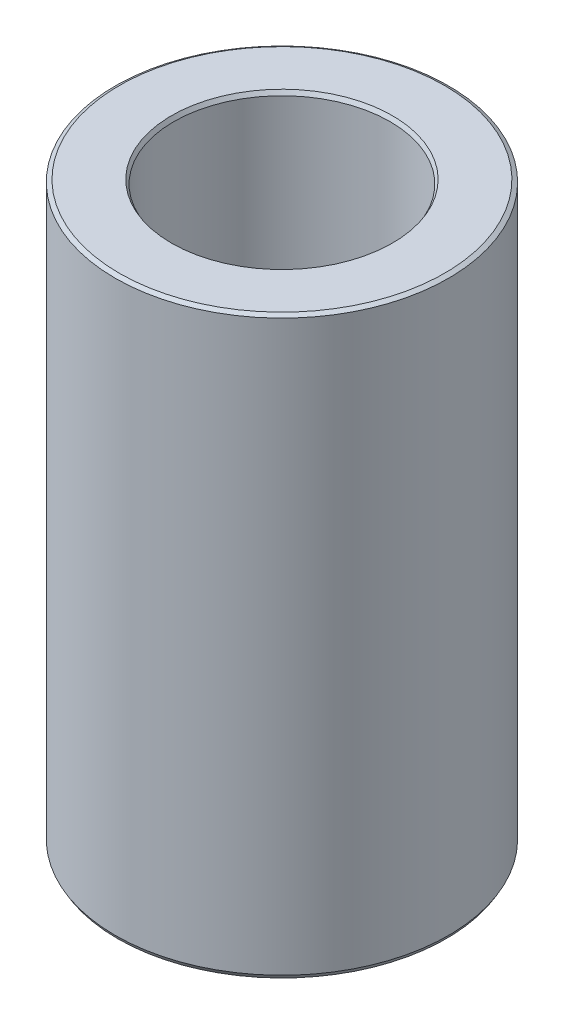
ISO-10303-21;
HEADER;
FILE_DESCRIPTION(('STEP AP214'),'2;1');
FILE_NAME('part.step','',(''),(''),'','','');
FILE_SCHEMA(('AUTOMOTIVE_DESIGN { 1 0 10303 214 1 1 1 1 }'));
ENDSEC;
DATA;
#1=APPLICATION_CONTEXT('core data for automotive mechanical design processes');
#2=APPLICATION_PROTOCOL_DEFINITION('international standard','automotive_design',2000,#1);
#3=PRODUCT_CONTEXT('',#1,'mechanical');
#4=PRODUCT('Part','Part','',(#3));
#5=PRODUCT_RELATED_PRODUCT_CATEGORY('part','',(#4));
#6=PRODUCT_DEFINITION_FORMATION('','',#4);
#7=PRODUCT_DEFINITION_CONTEXT('part definition',#1,'design');
#8=PRODUCT_DEFINITION('design','',#6,#7);
#9=PRODUCT_DEFINITION_SHAPE('','',#8);
#10=(LENGTH_UNIT() NAMED_UNIT(*) SI_UNIT(.MILLI.,.METRE.));
#11=(NAMED_UNIT(*) PLANE_ANGLE_UNIT() SI_UNIT($,.RADIAN.));
#12=(NAMED_UNIT(*) SI_UNIT($,.STERADIAN.) SOLID_ANGLE_UNIT());
#13=UNCERTAINTY_MEASURE_WITH_UNIT(LENGTH_MEASURE(1.E-05),#10,'distance_accuracy_value','');
#14=(GEOMETRIC_REPRESENTATION_CONTEXT(3) GLOBAL_UNCERTAINTY_ASSIGNED_CONTEXT((#13)) GLOBAL_UNIT_ASSIGNED_CONTEXT((#10,
#11,#12)) REPRESENTATION_CONTEXT('',''));
#15=CARTESIAN_POINT('',(0.,0.,0.));
#16=DIRECTION('',(0.,0.,1.));
#17=DIRECTION('',(1.,0.,0.));
#18=AXIS2_PLACEMENT_3D('',#15,#16,#17);
#19=CARTESIAN_POINT('',(0.,189.913354493686,0.));
#20=DIRECTION('',(0.,-1.,0.));
#21=DIRECTION('',(0.,0.,-1.));
#22=AXIS2_PLACEMENT_3D('',#19,#20,#21);
#23=CYLINDRICAL_SURFACE('',#22,55.);
#24=CARTESIAN_POINT('',(0.,1.32773117109544,0.));
#25=DIRECTION('',(0.,1.,0.));
#26=DIRECTION('',(0.,0.,1.));
#27=AXIS2_PLACEMENT_3D('',#24,#25,#26);
#28=CIRCLE('',#27,55.);
#29=CARTESIAN_POINT('',(0.,1.32773117109544,55.));
#30=VERTEX_POINT('',#29);
#31=EDGE_CURVE('E10',#30,#30,#28,.T.);
#32=ORIENTED_EDGE('',*,*,#31,.T.);
#33=EDGE_LOOP('',(#32));
#34=FACE_BOUND('',#33,.T.);
#35=CARTESIAN_POINT('',(0.,189.146788544643,0.));
#36=DIRECTION('',(0.,1.,0.));
#37=DIRECTION('',(0.,0.,1.));
#38=AXIS2_PLACEMENT_3D('',#35,#36,#37);
#39=CIRCLE('',#38,55.);
#40=CARTESIAN_POINT('',(0.,189.146788544643,55.));
#41=VERTEX_POINT('',#40);
#42=EDGE_CURVE('E50',#41,#41,#39,.F.);
#43=ORIENTED_EDGE('',*,*,#42,.T.);
#44=EDGE_LOOP('',(#43));
#45=FACE_BOUND('',#44,.T.);
#46=ADVANCED_FACE('F39',(#34,#45),#23,.T.);
#47=CARTESIAN_POINT('',(0.,189.913354493686,0.));
#48=DIRECTION('',(0.,1.,0.));
#49=DIRECTION('',(0.,0.,1.));
#50=AXIS2_PLACEMENT_3D('',#47,#48,#49);
#51=PLANE('',#50);
#52=CARTESIAN_POINT('',(0.,189.913354493686,0.));
#53=DIRECTION('',(0.,1.,0.));
#54=DIRECTION('',(0.,0.,1.));
#55=AXIS2_PLACEMENT_3D('',#52,#53,#54);
#56=CIRCLE('',#55,36.4551856173983);
#57=CARTESIAN_POINT('',(0.,189.913354493686,36.4551856173983));
#58=VERTEX_POINT('',#57);
#59=EDGE_CURVE('E58',#58,#58,#56,.F.);
#60=ORIENTED_EDGE('',*,*,#59,.T.);
#61=EDGE_LOOP('',(#60));
#62=FACE_BOUND('',#61,.T.);
#63=CARTESIAN_POINT('',(0.,189.913354493686,0.));
#64=DIRECTION('',(0.,1.,0.));
#65=DIRECTION('',(0.,0.,1.));
#66=AXIS2_PLACEMENT_3D('',#63,#64,#65);
#67=CIRCLE('',#66,53.6722688289047);
#68=CARTESIAN_POINT('',(0.,189.913354493686,53.6722688289047));
#69=VERTEX_POINT('',#68);
#70=EDGE_CURVE('E61',#69,#69,#67,.T.);
#71=ORIENTED_EDGE('',*,*,#70,.T.);
#72=EDGE_LOOP('',(#71));
#73=FACE_BOUND('',#72,.T.);
#74=ADVANCED_FACE('F88',(#62,#73),#51,.T.);
#75=CARTESIAN_POINT('',(0.,0.,0.));
#76=DIRECTION('',(0.,1.,0.));
#77=DIRECTION('',(0.,0.,1.));
#78=AXIS2_PLACEMENT_3D('',#75,#76,#77);
#79=PLANE('',#78);
#80=CARTESIAN_POINT('',(0.,0.,0.));
#81=DIRECTION('',(0.,1.,0.));
#82=DIRECTION('',(0.,0.,1.));
#83=AXIS2_PLACEMENT_3D('',#80,#81,#82);
#84=CIRCLE('',#83,37.0163508394503);
#85=CARTESIAN_POINT('',(0.,0.,37.0163508394503));
#86=VERTEX_POINT('',#85);
#87=EDGE_CURVE('E51',#86,#86,#84,.T.);
#88=ORIENTED_EDGE('',*,*,#87,.T.);
#89=EDGE_LOOP('',(#88));
#90=FACE_BOUND('',#89,.T.);
#91=CARTESIAN_POINT('',(0.,0.,0.));
#92=DIRECTION('',(0.,1.,0.));
#93=DIRECTION('',(0.,0.,1.));
#94=AXIS2_PLACEMENT_3D('',#91,#92,#93);
#95=CIRCLE('',#94,54.2334340509566);
#96=CARTESIAN_POINT('',(0.,0.,54.2334340509566));
#97=VERTEX_POINT('',#96);
#98=EDGE_CURVE('E54',#97,#97,#95,.F.);
#99=ORIENTED_EDGE('',*,*,#98,.T.);
#100=EDGE_LOOP('',(#99));
#101=FACE_BOUND('',#100,.T.);
#102=ADVANCED_FACE('F83',(#90,#101),#79,.F.);
#103=CARTESIAN_POINT('',(0.,189.913354493686,0.));
#104=DIRECTION('',(0.,-1.,0.));
#105=DIRECTION('',(0.,0.,-1.));
#106=AXIS2_PLACEMENT_3D('',#103,#104,#105);
#107=CYLINDRICAL_SURFACE('',#106,35.688619668355);
#108=CARTESIAN_POINT('',(0.,188.585623322591,0.));
#109=DIRECTION('',(0.,1.,0.));
#110=DIRECTION('',(0.,0.,1.));
#111=AXIS2_PLACEMENT_3D('',#108,#109,#110);
#112=CIRCLE('',#111,35.688619668355);
#113=CARTESIAN_POINT('',(0.,188.585623322591,35.688619668355));
#114=VERTEX_POINT('',#113);
#115=EDGE_CURVE('E67',#114,#114,#112,.T.);
#116=ORIENTED_EDGE('',*,*,#115,.T.);
#117=EDGE_LOOP('',(#116));
#118=FACE_BOUND('',#117,.T.);
#119=CARTESIAN_POINT('',(0.,0.766565949043341,0.));
#120=DIRECTION('',(0.,1.,0.));
#121=DIRECTION('',(0.,0.,1.));
#122=AXIS2_PLACEMENT_3D('',#119,#120,#121);
#123=CIRCLE('',#122,35.688619668355);
#124=CARTESIAN_POINT('',(0.,0.766565949043341,35.688619668355));
#125=VERTEX_POINT('',#124);
#126=EDGE_CURVE('E69',#125,#125,#123,.F.);
#127=ORIENTED_EDGE('',*,*,#126,.T.);
#128=EDGE_LOOP('',(#127));
#129=FACE_BOUND('',#128,.T.);
#130=ADVANCED_FACE('F71',(#118,#129),#107,.F.);
#131=CARTESIAN_POINT('',(0.,188.585623322591,0.));
#132=DIRECTION('',(0.,1.,0.));
#133=DIRECTION('',(0.,0.,1.));
#134=AXIS2_PLACEMENT_3D('',#131,#132,#133);
#135=CONICAL_SURFACE('',#134,35.688619668355,0.523598775598306);
#136=ORIENTED_EDGE('',*,*,#59,.F.);
#137=EDGE_LOOP('',(#136));
#138=FACE_BOUND('',#137,.T.);
#139=ORIENTED_EDGE('',*,*,#115,.F.);
#140=EDGE_LOOP('',(#139));
#141=FACE_BOUND('',#140,.T.);
#142=ADVANCED_FACE('F77',(#138,#141),#135,.F.);
#143=CARTESIAN_POINT('',(0.,0.,0.));
#144=DIRECTION('',(0.,-1.,0.));
#145=DIRECTION('',(0.,0.,-1.));
#146=AXIS2_PLACEMENT_3D('',#143,#144,#145);
#147=CONICAL_SURFACE('',#146,37.0163508394503,1.0471975511966);
#148=ORIENTED_EDGE('',*,*,#126,.F.);
#149=EDGE_LOOP('',(#148));
#150=FACE_BOUND('',#149,.T.);
#151=ORIENTED_EDGE('',*,*,#87,.F.);
#152=EDGE_LOOP('',(#151));
#153=FACE_BOUND('',#152,.T.);
#154=ADVANCED_FACE('F73',(#150,#153),#147,.F.);
#155=CARTESIAN_POINT('',(0.,1.32773117109544,0.));
#156=DIRECTION('',(0.,1.,0.));
#157=DIRECTION('',(0.,0.,1.));
#158=AXIS2_PLACEMENT_3D('',#155,#156,#157);
#159=CONICAL_SURFACE('',#158,55.,0.523598775598302);
#160=ORIENTED_EDGE('',*,*,#98,.F.);
#161=EDGE_LOOP('',(#160));
#162=FACE_BOUND('',#161,.T.);
#163=ORIENTED_EDGE('',*,*,#31,.F.);
#164=EDGE_LOOP('',(#163));
#165=FACE_BOUND('',#164,.T.);
#166=ADVANCED_FACE('F76',(#162,#165),#159,.T.);
#167=CARTESIAN_POINT('',(0.,189.913354493686,0.));
#168=DIRECTION('',(0.,-1.,0.));
#169=DIRECTION('',(0.,0.,-1.));
#170=AXIS2_PLACEMENT_3D('',#167,#168,#169);
#171=CONICAL_SURFACE('',#170,53.6722688289047,1.04719755119659);
#172=ORIENTED_EDGE('',*,*,#42,.F.);
#173=EDGE_LOOP('',(#172));
#174=FACE_BOUND('',#173,.T.);
#175=ORIENTED_EDGE('',*,*,#70,.F.);
#176=EDGE_LOOP('',(#175));
#177=FACE_BOUND('',#176,.T.);
#178=ADVANCED_FACE('F45',(#174,#177),#171,.T.);
#179=CLOSED_SHELL('',(#46,#74,#102,#130,#142,#154,#166,#178));
#180=MANIFOLD_SOLID_BREP('B2',#179);
#181=ADVANCED_BREP_SHAPE_REPRESENTATION('',(#18,#180),#14);
#182=SHAPE_DEFINITION_REPRESENTATION(#9,#181);
ENDSEC;
END-ISO-10303-21;
